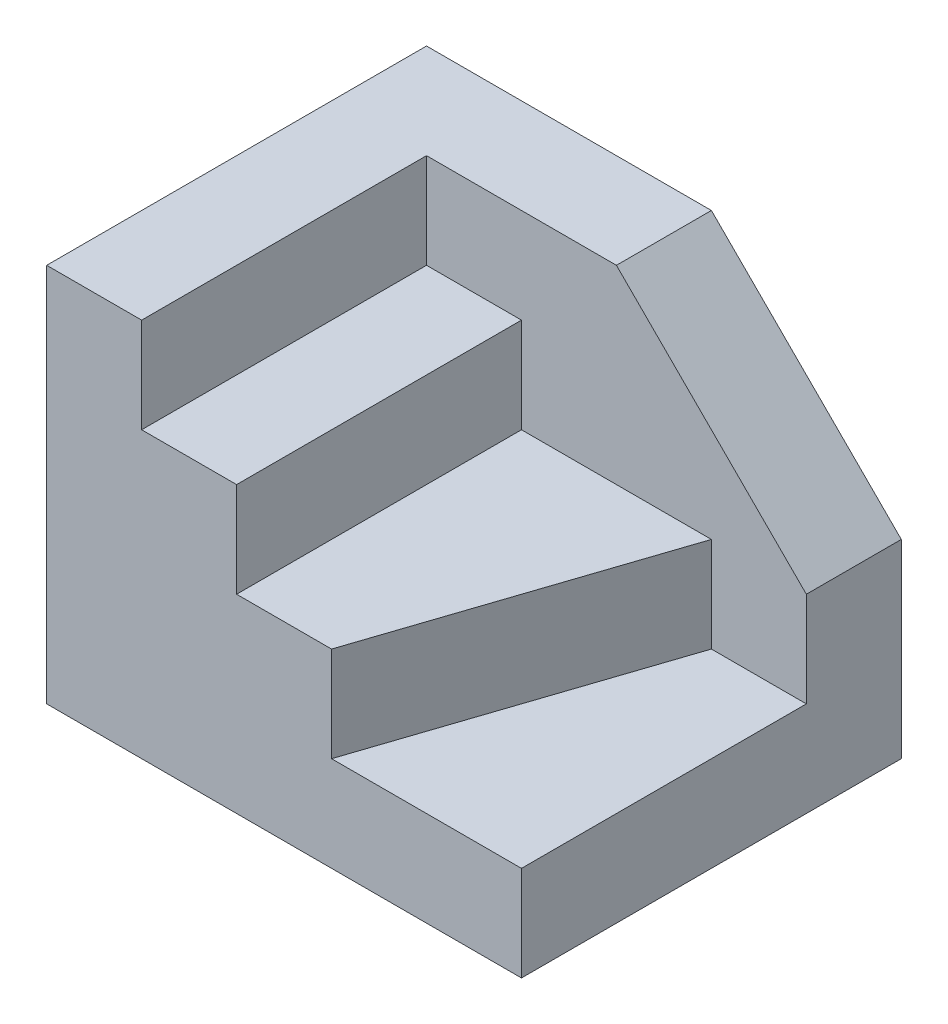
ISO-10303-21;
HEADER;
FILE_DESCRIPTION(('STEP AP214'),'2;1');
FILE_NAME('part.step','',(''),(''),'','','');
FILE_SCHEMA(('AUTOMOTIVE_DESIGN { 1 0 10303 214 1 1 1 1 }'));
ENDSEC;
DATA;
#1=APPLICATION_CONTEXT('core data for automotive mechanical design processes');
#2=APPLICATION_PROTOCOL_DEFINITION('international standard','automotive_design',2000,#1);
#3=PRODUCT_CONTEXT('',#1,'mechanical');
#4=PRODUCT('Part','Part','',(#3));
#5=PRODUCT_RELATED_PRODUCT_CATEGORY('part','',(#4));
#6=PRODUCT_DEFINITION_FORMATION('','',#4);
#7=PRODUCT_DEFINITION_CONTEXT('part definition',#1,'design');
#8=PRODUCT_DEFINITION('design','',#6,#7);
#9=PRODUCT_DEFINITION_SHAPE('','',#8);
#10=(LENGTH_UNIT() NAMED_UNIT(*) SI_UNIT(.MILLI.,.METRE.));
#11=(NAMED_UNIT(*) PLANE_ANGLE_UNIT() SI_UNIT($,.RADIAN.));
#12=(NAMED_UNIT(*) SI_UNIT($,.STERADIAN.) SOLID_ANGLE_UNIT());
#13=UNCERTAINTY_MEASURE_WITH_UNIT(LENGTH_MEASURE(1.E-05),#10,'distance_accuracy_value','');
#14=(GEOMETRIC_REPRESENTATION_CONTEXT(3) GLOBAL_UNCERTAINTY_ASSIGNED_CONTEXT((#13)) GLOBAL_UNIT_ASSIGNED_CONTEXT((#10,
#11,#12)) REPRESENTATION_CONTEXT('',''));
#15=CARTESIAN_POINT('',(0.,0.,0.));
#16=DIRECTION('',(0.,0.,1.));
#17=DIRECTION('',(1.,0.,0.));
#18=AXIS2_PLACEMENT_3D('',#15,#16,#17);
#19=CARTESIAN_POINT('',(0.,1.,0.));
#20=DIRECTION('',(0.,1.,0.));
#21=DIRECTION('',(0.,0.,1.));
#22=AXIS2_PLACEMENT_3D('',#19,#20,#21);
#23=PLANE('',#22);
#24=DIRECTION('',(1.,0.,0.));
#25=VECTOR('',#24,1.);
#26=CARTESIAN_POINT('',(0.,1.,-0.999999999999999));
#27=LINE('',#26,#25);
#28=CARTESIAN_POINT('',(1.5,1.,-0.999999999999999));
#29=VERTEX_POINT('',#28);
#30=CARTESIAN_POINT('',(2.5,1.,-0.999999999999999));
#31=VERTEX_POINT('',#30);
#32=EDGE_CURVE('E156',#29,#31,#27,.T.);
#33=ORIENTED_EDGE('',*,*,#32,.F.);
#34=DIRECTION('',(0.316227766016838,0.,-0.948683298050514));
#35=VECTOR('',#34,1.);
#36=CARTESIAN_POINT('',(1.05,1.,0.35));
#37=LINE('',#36,#35);
#38=CARTESIAN_POINT('',(0.5,1.,2.));
#39=VERTEX_POINT('',#38);
#40=EDGE_CURVE('E114',#39,#29,#37,.T.);
#41=ORIENTED_EDGE('',*,*,#40,.F.);
#42=DIRECTION('',(-1.,0.,0.));
#43=VECTOR('',#42,1.);
#44=CARTESIAN_POINT('',(0.,1.,2.));
#45=LINE('',#44,#43);
#46=CARTESIAN_POINT('',(2.5,1.,2.));
#47=VERTEX_POINT('',#46);
#48=EDGE_CURVE('E101',#47,#39,#45,.T.);
#49=ORIENTED_EDGE('',*,*,#48,.F.);
#50=DIRECTION('',(0.,0.,-1.));
#51=VECTOR('',#50,1.);
#52=CARTESIAN_POINT('',(2.5,1.,0.));
#53=LINE('',#52,#51);
#54=EDGE_CURVE('E103',#47,#31,#53,.T.);
#55=ORIENTED_EDGE('',*,*,#54,.T.);
#56=EDGE_LOOP('',(#33,#41,#49,#55));
#57=FACE_BOUND('',#56,.T.);
#58=ADVANCED_FACE('F35',(#57),#23,.T.);
#59=CARTESIAN_POINT('',(0.,1.,2.));
#60=DIRECTION('',(0.,0.,1.));
#61=DIRECTION('',(1.,0.,0.));
#62=AXIS2_PLACEMENT_3D('',#59,#60,#61);
#63=PLANE('',#62);
#64=DIRECTION('',(-1.,0.,0.));
#65=VECTOR('',#64,1.);
#66=CARTESIAN_POINT('',(0.,4.,2.));
#67=LINE('',#66,#65);
#68=CARTESIAN_POINT('',(-1.5,4.,2.));
#69=VERTEX_POINT('',#68);
#70=CARTESIAN_POINT('',(-2.5,4.,2.));
#71=VERTEX_POINT('',#70);
#72=EDGE_CURVE('E167',#69,#71,#67,.T.);
#73=ORIENTED_EDGE('',*,*,#72,.T.);
#74=DIRECTION('',(0.,-1.,0.));
#75=VECTOR('',#74,1.);
#76=CARTESIAN_POINT('',(-2.5,1.,2.));
#77=LINE('',#76,#75);
#78=CARTESIAN_POINT('',(-2.5,0.,2.));
#79=VERTEX_POINT('',#78);
#80=EDGE_CURVE('E87',#71,#79,#77,.T.);
#81=ORIENTED_EDGE('',*,*,#80,.T.);
#82=DIRECTION('',(-1.,0.,0.));
#83=VECTOR('',#82,1.);
#84=CARTESIAN_POINT('',(0.,0.,2.));
#85=LINE('',#84,#83);
#86=CARTESIAN_POINT('',(2.5,0.,2.));
#87=VERTEX_POINT('',#86);
#88=EDGE_CURVE('E99',#87,#79,#85,.T.);
#89=ORIENTED_EDGE('',*,*,#88,.F.);
#90=DIRECTION('',(0.,-1.,0.));
#91=VECTOR('',#90,1.);
#92=CARTESIAN_POINT('',(2.5,1.,2.));
#93=LINE('',#92,#91);
#94=EDGE_CURVE('E43',#47,#87,#93,.T.);
#95=ORIENTED_EDGE('',*,*,#94,.F.);
#96=ORIENTED_EDGE('',*,*,#48,.T.);
#97=DIRECTION('',(0.,-1.,0.));
#98=VECTOR('',#97,1.);
#99=CARTESIAN_POINT('',(0.5,2.,2.));
#100=LINE('',#99,#98);
#101=CARTESIAN_POINT('',(0.5,2.,2.));
#102=VERTEX_POINT('',#101);
#103=EDGE_CURVE('E123',#102,#39,#100,.T.);
#104=ORIENTED_EDGE('',*,*,#103,.F.);
#105=DIRECTION('',(-1.,0.,0.));
#106=VECTOR('',#105,1.);
#107=CARTESIAN_POINT('',(0.,2.,2.));
#108=LINE('',#107,#106);
#109=CARTESIAN_POINT('',(-0.5,2.,2.));
#110=VERTEX_POINT('',#109);
#111=EDGE_CURVE('E126',#102,#110,#108,.T.);
#112=ORIENTED_EDGE('',*,*,#111,.T.);
#113=DIRECTION('',(0.,-1.,0.));
#114=VECTOR('',#113,1.);
#115=CARTESIAN_POINT('',(-0.5,3.,2.));
#116=LINE('',#115,#114);
#117=CARTESIAN_POINT('',(-0.5,3.,2.));
#118=VERTEX_POINT('',#117);
#119=EDGE_CURVE('E138',#118,#110,#116,.T.);
#120=ORIENTED_EDGE('',*,*,#119,.F.);
#121=DIRECTION('',(-1.,0.,0.));
#122=VECTOR('',#121,1.);
#123=CARTESIAN_POINT('',(0.,3.,2.));
#124=LINE('',#123,#122);
#125=CARTESIAN_POINT('',(-1.5,3.,2.));
#126=VERTEX_POINT('',#125);
#127=EDGE_CURVE('E153',#118,#126,#124,.T.);
#128=ORIENTED_EDGE('',*,*,#127,.T.);
#129=DIRECTION('',(0.,-1.,0.));
#130=VECTOR('',#129,1.);
#131=CARTESIAN_POINT('',(-1.5,4.,2.));
#132=LINE('',#131,#130);
#133=EDGE_CURVE('E164',#69,#126,#132,.T.);
#134=ORIENTED_EDGE('',*,*,#133,.F.);
#135=EDGE_LOOP('',(#73,#81,#89,#95,#96,#104,#112,#120,#128,#134));
#136=FACE_BOUND('',#135,.T.);
#137=ADVANCED_FACE('F37',(#136),#63,.T.);
#138=CARTESIAN_POINT('',(2.5,1.,0.));
#139=DIRECTION('',(-1.,0.,0.));
#140=DIRECTION('',(0.,0.,1.));
#141=AXIS2_PLACEMENT_3D('',#138,#139,#140);
#142=PLANE('',#141);
#143=DIRECTION('',(0.,-1.,0.));
#144=VECTOR('',#143,1.);
#145=CARTESIAN_POINT('',(2.5,1.,-2.));
#146=LINE('',#145,#144);
#147=CARTESIAN_POINT('',(2.5,2.,-2.));
#148=VERTEX_POINT('',#147);
#149=CARTESIAN_POINT('',(2.5,0.,-2.));
#150=VERTEX_POINT('',#149);
#151=EDGE_CURVE('E86',#148,#150,#146,.T.);
#152=ORIENTED_EDGE('',*,*,#151,.F.);
#153=DIRECTION('',(0.,0.,1.));
#154=VECTOR('',#153,1.);
#155=CARTESIAN_POINT('',(2.5,2.,-5.));
#156=LINE('',#155,#154);
#157=CARTESIAN_POINT('',(2.5,2.,-0.999999999999999));
#158=VERTEX_POINT('',#157);
#159=EDGE_CURVE('E180',#148,#158,#156,.T.);
#160=ORIENTED_EDGE('',*,*,#159,.T.);
#161=DIRECTION('',(0.,-1.,0.));
#162=VECTOR('',#161,1.);
#163=CARTESIAN_POINT('',(2.5,4.,-0.999999999999999));
#164=LINE('',#163,#162);
#165=EDGE_CURVE('E162',#158,#31,#164,.T.);
#166=ORIENTED_EDGE('',*,*,#165,.T.);
#167=ORIENTED_EDGE('',*,*,#54,.F.);
#168=ORIENTED_EDGE('',*,*,#94,.T.);
#169=DIRECTION('',(0.,0.,-1.));
#170=VECTOR('',#169,1.);
#171=CARTESIAN_POINT('',(2.5,0.,0.));
#172=LINE('',#171,#170);
#173=EDGE_CURVE('E96',#87,#150,#172,.T.);
#174=ORIENTED_EDGE('',*,*,#173,.T.);
#175=EDGE_LOOP('',(#152,#160,#166,#167,#168,#174));
#176=FACE_BOUND('',#175,.T.);
#177=ADVANCED_FACE('F109',(#176),#142,.F.);
#178=CARTESIAN_POINT('',(0.,1.,-2.));
#179=DIRECTION('',(0.,0.,1.));
#180=DIRECTION('',(1.,0.,0.));
#181=AXIS2_PLACEMENT_3D('',#178,#179,#180);
#182=PLANE('',#181);
#183=DIRECTION('',(-1.,0.,0.));
#184=VECTOR('',#183,1.);
#185=CARTESIAN_POINT('',(0.,4.,-2.));
#186=LINE('',#185,#184);
#187=CARTESIAN_POINT('',(0.5,4.,-2.));
#188=VERTEX_POINT('',#187);
#189=CARTESIAN_POINT('',(-2.5,4.,-2.));
#190=VERTEX_POINT('',#189);
#191=EDGE_CURVE('E170',#188,#190,#186,.T.);
#192=ORIENTED_EDGE('',*,*,#191,.F.);
#193=DIRECTION('',(0.707106781186548,-0.707106781186548,0.));
#194=VECTOR('',#193,1.);
#195=CARTESIAN_POINT('',(1.75,2.75,-2.));
#196=LINE('',#195,#194);
#197=EDGE_CURVE('E49',#188,#148,#196,.T.);
#198=ORIENTED_EDGE('',*,*,#197,.T.);
#199=ORIENTED_EDGE('',*,*,#151,.T.);
#200=DIRECTION('',(-1.,0.,0.));
#201=VECTOR('',#200,1.);
#202=CARTESIAN_POINT('',(0.,0.,-2.));
#203=LINE('',#202,#201);
#204=CARTESIAN_POINT('',(-2.5,0.,-2.));
#205=VERTEX_POINT('',#204);
#206=EDGE_CURVE('E90',#150,#205,#203,.T.);
#207=ORIENTED_EDGE('',*,*,#206,.T.);
#208=DIRECTION('',(0.,-1.,0.));
#209=VECTOR('',#208,1.);
#210=CARTESIAN_POINT('',(-2.5,1.,-2.));
#211=LINE('',#210,#209);
#212=EDGE_CURVE('E75',#190,#205,#211,.T.);
#213=ORIENTED_EDGE('',*,*,#212,.F.);
#214=EDGE_LOOP('',(#192,#198,#199,#207,#213));
#215=FACE_BOUND('',#214,.T.);
#216=ADVANCED_FACE('F91',(#215),#182,.F.);
#217=CARTESIAN_POINT('',(-2.5,1.,0.));
#218=DIRECTION('',(-1.,0.,0.));
#219=DIRECTION('',(0.,0.,1.));
#220=AXIS2_PLACEMENT_3D('',#217,#218,#219);
#221=PLANE('',#220);
#222=DIRECTION('',(0.,0.,-1.));
#223=VECTOR('',#222,1.);
#224=CARTESIAN_POINT('',(-2.5,0.,0.));
#225=LINE('',#224,#223);
#226=EDGE_CURVE('E80',#79,#205,#225,.T.);
#227=ORIENTED_EDGE('',*,*,#226,.F.);
#228=ORIENTED_EDGE('',*,*,#80,.F.);
#229=DIRECTION('',(0.,0.,-1.));
#230=VECTOR('',#229,1.);
#231=CARTESIAN_POINT('',(-2.5,4.,0.));
#232=LINE('',#231,#230);
#233=EDGE_CURVE('E83',#71,#190,#232,.T.);
#234=ORIENTED_EDGE('',*,*,#233,.T.);
#235=ORIENTED_EDGE('',*,*,#212,.T.);
#236=EDGE_LOOP('',(#227,#228,#234,#235));
#237=FACE_BOUND('',#236,.T.);
#238=ADVANCED_FACE('F77',(#237),#221,.T.);
#239=CARTESIAN_POINT('',(0.,0.,0.));
#240=DIRECTION('',(0.,1.,0.));
#241=DIRECTION('',(0.,0.,1.));
#242=AXIS2_PLACEMENT_3D('',#239,#240,#241);
#243=PLANE('',#242);
#244=ORIENTED_EDGE('',*,*,#88,.T.);
#245=ORIENTED_EDGE('',*,*,#226,.T.);
#246=ORIENTED_EDGE('',*,*,#206,.F.);
#247=ORIENTED_EDGE('',*,*,#173,.F.);
#248=EDGE_LOOP('',(#244,#245,#246,#247));
#249=FACE_BOUND('',#248,.T.);
#250=ADVANCED_FACE('F98',(#249),#243,.F.);
#251=CARTESIAN_POINT('',(1.05,2.,0.35));
#252=DIRECTION('',(0.948683298050514,0.,0.316227766016838));
#253=DIRECTION('',(0.316227766016838,0.,-0.948683298050514));
#254=AXIS2_PLACEMENT_3D('',#251,#252,#253);
#255=PLANE('',#254);
#256=ORIENTED_EDGE('',*,*,#103,.T.);
#257=ORIENTED_EDGE('',*,*,#40,.T.);
#258=DIRECTION('',(0.,-1.,0.));
#259=VECTOR('',#258,1.);
#260=CARTESIAN_POINT('',(1.5,2.,-0.999999999999999));
#261=LINE('',#260,#259);
#262=CARTESIAN_POINT('',(1.5,2.,-0.999999999999999));
#263=VERTEX_POINT('',#262);
#264=EDGE_CURVE('E117',#263,#29,#261,.T.);
#265=ORIENTED_EDGE('',*,*,#264,.F.);
#266=DIRECTION('',(-0.316227766016838,0.,0.948683298050514));
#267=VECTOR('',#266,1.);
#268=CARTESIAN_POINT('',(1.05,2.,0.35));
#269=LINE('',#268,#267);
#270=EDGE_CURVE('E135',#263,#102,#269,.T.);
#271=ORIENTED_EDGE('',*,*,#270,.T.);
#272=EDGE_LOOP('',(#256,#257,#265,#271));
#273=FACE_BOUND('',#272,.T.);
#274=ADVANCED_FACE('F260',(#273),#255,.T.);
#275=CARTESIAN_POINT('',(0.,2.,0.));
#276=DIRECTION('',(0.,1.,0.));
#277=DIRECTION('',(0.,0.,1.));
#278=AXIS2_PLACEMENT_3D('',#275,#276,#277);
#279=PLANE('',#278);
#280=ORIENTED_EDGE('',*,*,#270,.F.);
#281=DIRECTION('',(-1.,0.,0.));
#282=VECTOR('',#281,1.);
#283=CARTESIAN_POINT('',(0.,2.,-0.999999999999999));
#284=LINE('',#283,#282);
#285=CARTESIAN_POINT('',(-0.5,2.,-0.999999999999999));
#286=VERTEX_POINT('',#285);
#287=EDGE_CURVE('E132',#263,#286,#284,.T.);
#288=ORIENTED_EDGE('',*,*,#287,.T.);
#289=DIRECTION('',(0.,0.,-1.));
#290=VECTOR('',#289,1.);
#291=CARTESIAN_POINT('',(-0.5,2.,0.));
#292=LINE('',#291,#290);
#293=EDGE_CURVE('E129',#110,#286,#292,.T.);
#294=ORIENTED_EDGE('',*,*,#293,.F.);
#295=ORIENTED_EDGE('',*,*,#111,.F.);
#296=EDGE_LOOP('',(#280,#288,#294,#295));
#297=FACE_BOUND('',#296,.T.);
#298=ADVANCED_FACE('F250',(#297),#279,.T.);
#299=CARTESIAN_POINT('',(-0.5,3.,0.));
#300=DIRECTION('',(-1.,0.,0.));
#301=DIRECTION('',(0.,0.,1.));
#302=AXIS2_PLACEMENT_3D('',#299,#300,#301);
#303=PLANE('',#302);
#304=ORIENTED_EDGE('',*,*,#293,.T.);
#305=DIRECTION('',(0.,-1.,0.));
#306=VECTOR('',#305,1.);
#307=CARTESIAN_POINT('',(-0.5,3.,-0.999999999999999));
#308=LINE('',#307,#306);
#309=CARTESIAN_POINT('',(-0.5,3.,-0.999999999999999));
#310=VERTEX_POINT('',#309);
#311=EDGE_CURVE('E141',#310,#286,#308,.T.);
#312=ORIENTED_EDGE('',*,*,#311,.F.);
#313=DIRECTION('',(0.,0.,-1.));
#314=VECTOR('',#313,1.);
#315=CARTESIAN_POINT('',(-0.5,3.,0.));
#316=LINE('',#315,#314);
#317=EDGE_CURVE('E150',#118,#310,#316,.T.);
#318=ORIENTED_EDGE('',*,*,#317,.F.);
#319=ORIENTED_EDGE('',*,*,#119,.T.);
#320=EDGE_LOOP('',(#304,#312,#318,#319));
#321=FACE_BOUND('',#320,.T.);
#322=ADVANCED_FACE('F252',(#321),#303,.F.);
#323=CARTESIAN_POINT('',(0.,3.,0.));
#324=DIRECTION('',(0.,1.,0.));
#325=DIRECTION('',(0.,0.,1.));
#326=AXIS2_PLACEMENT_3D('',#323,#324,#325);
#327=PLANE('',#326);
#328=ORIENTED_EDGE('',*,*,#127,.F.);
#329=ORIENTED_EDGE('',*,*,#317,.T.);
#330=DIRECTION('',(-1.,0.,0.));
#331=VECTOR('',#330,1.);
#332=CARTESIAN_POINT('',(0.,3.,-0.999999999999999));
#333=LINE('',#332,#331);
#334=CARTESIAN_POINT('',(-1.5,3.,-0.999999999999998));
#335=VERTEX_POINT('',#334);
#336=EDGE_CURVE('E147',#310,#335,#333,.T.);
#337=ORIENTED_EDGE('',*,*,#336,.T.);
#338=DIRECTION('',(0.,0.,1.));
#339=VECTOR('',#338,1.);
#340=CARTESIAN_POINT('',(-1.5,3.,0.));
#341=LINE('',#340,#339);
#342=EDGE_CURVE('E144',#335,#126,#341,.T.);
#343=ORIENTED_EDGE('',*,*,#342,.T.);
#344=EDGE_LOOP('',(#328,#329,#337,#343));
#345=FACE_BOUND('',#344,.T.);
#346=ADVANCED_FACE('F244',(#345),#327,.T.);
#347=CARTESIAN_POINT('',(-1.5,4.,0.));
#348=DIRECTION('',(1.,0.,0.));
#349=DIRECTION('',(0.,0.,-1.));
#350=AXIS2_PLACEMENT_3D('',#347,#348,#349);
#351=PLANE('',#350);
#352=ORIENTED_EDGE('',*,*,#133,.T.);
#353=ORIENTED_EDGE('',*,*,#342,.F.);
#354=DIRECTION('',(0.,-1.,0.));
#355=VECTOR('',#354,1.);
#356=CARTESIAN_POINT('',(-1.5,4.,-0.999999999999998));
#357=LINE('',#356,#355);
#358=CARTESIAN_POINT('',(-1.5,4.,-0.999999999999998));
#359=VERTEX_POINT('',#358);
#360=EDGE_CURVE('E159',#359,#335,#357,.T.);
#361=ORIENTED_EDGE('',*,*,#360,.F.);
#362=DIRECTION('',(0.,0.,1.));
#363=VECTOR('',#362,1.);
#364=CARTESIAN_POINT('',(-1.5,4.,0.));
#365=LINE('',#364,#363);
#366=EDGE_CURVE('E176',#359,#69,#365,.T.);
#367=ORIENTED_EDGE('',*,*,#366,.T.);
#368=EDGE_LOOP('',(#352,#353,#361,#367));
#369=FACE_BOUND('',#368,.T.);
#370=ADVANCED_FACE('F239',(#369),#351,.T.);
#371=CARTESIAN_POINT('',(0.,4.,-0.999999999999999));
#372=DIRECTION('',(0.,0.,1.));
#373=DIRECTION('',(1.,0.,0.));
#374=AXIS2_PLACEMENT_3D('',#371,#372,#373);
#375=PLANE('',#374);
#376=DIRECTION('',(0.707106781186548,-0.707106781186548,0.));
#377=VECTOR('',#376,1.);
#378=CARTESIAN_POINT('',(0.5,4.,-0.999999999999999));
#379=LINE('',#378,#377);
#380=CARTESIAN_POINT('',(0.5,4.,-0.999999999999999));
#381=VERTEX_POINT('',#380);
#382=EDGE_CURVE('E183',#381,#158,#379,.T.);
#383=ORIENTED_EDGE('',*,*,#382,.F.);
#384=DIRECTION('',(-1.,0.,0.));
#385=VECTOR('',#384,1.);
#386=CARTESIAN_POINT('',(0.,4.,-0.999999999999999));
#387=LINE('',#386,#385);
#388=EDGE_CURVE('E173',#381,#359,#387,.T.);
#389=ORIENTED_EDGE('',*,*,#388,.T.);
#390=ORIENTED_EDGE('',*,*,#360,.T.);
#391=ORIENTED_EDGE('',*,*,#336,.F.);
#392=ORIENTED_EDGE('',*,*,#311,.T.);
#393=ORIENTED_EDGE('',*,*,#287,.F.);
#394=ORIENTED_EDGE('',*,*,#264,.T.);
#395=ORIENTED_EDGE('',*,*,#32,.T.);
#396=ORIENTED_EDGE('',*,*,#165,.F.);
#397=EDGE_LOOP('',(#383,#389,#390,#391,#392,#393,#394,#395,#396));
#398=FACE_BOUND('',#397,.T.);
#399=ADVANCED_FACE('F195',(#398),#375,.T.);
#400=CARTESIAN_POINT('',(0.,4.,0.));
#401=DIRECTION('',(0.,1.,0.));
#402=DIRECTION('',(0.,0.,1.));
#403=AXIS2_PLACEMENT_3D('',#400,#401,#402);
#404=PLANE('',#403);
#405=DIRECTION('',(0.,0.,1.));
#406=VECTOR('',#405,1.);
#407=CARTESIAN_POINT('',(0.5,4.,0.));
#408=LINE('',#407,#406);
#409=EDGE_CURVE('E11',#188,#381,#408,.T.);
#410=ORIENTED_EDGE('',*,*,#409,.F.);
#411=ORIENTED_EDGE('',*,*,#191,.T.);
#412=ORIENTED_EDGE('',*,*,#233,.F.);
#413=ORIENTED_EDGE('',*,*,#72,.F.);
#414=ORIENTED_EDGE('',*,*,#366,.F.);
#415=ORIENTED_EDGE('',*,*,#388,.F.);
#416=EDGE_LOOP('',(#410,#411,#412,#413,#414,#415));
#417=FACE_BOUND('',#416,.T.);
#418=ADVANCED_FACE('F241',(#417),#404,.T.);
#419=CARTESIAN_POINT('',(0.5,4.,-5.));
#420=DIRECTION('',(-0.707106781186547,-0.707106781186547,0.));
#421=DIRECTION('',(0.707106781186548,-0.707106781186548,0.));
#422=AXIS2_PLACEMENT_3D('',#419,#420,#421);
#423=PLANE('',#422);
#424=ORIENTED_EDGE('',*,*,#409,.T.);
#425=ORIENTED_EDGE('',*,*,#382,.T.);
#426=ORIENTED_EDGE('',*,*,#159,.F.);
#427=ORIENTED_EDGE('',*,*,#197,.F.);
#428=EDGE_LOOP('',(#424,#425,#426,#427));
#429=FACE_BOUND('',#428,.T.);
#430=ADVANCED_FACE('F187',(#429),#423,.F.);
#431=CLOSED_SHELL('',(#58,#137,#177,#216,#238,#250,#274,#298,#322,#346,#370,#399,#418,#430));
#432=MANIFOLD_SOLID_BREP('B2',#431);
#433=ADVANCED_BREP_SHAPE_REPRESENTATION('',(#18,#432),#14);
#434=SHAPE_DEFINITION_REPRESENTATION(#9,#433);
ENDSEC;
END-ISO-10303-21;
